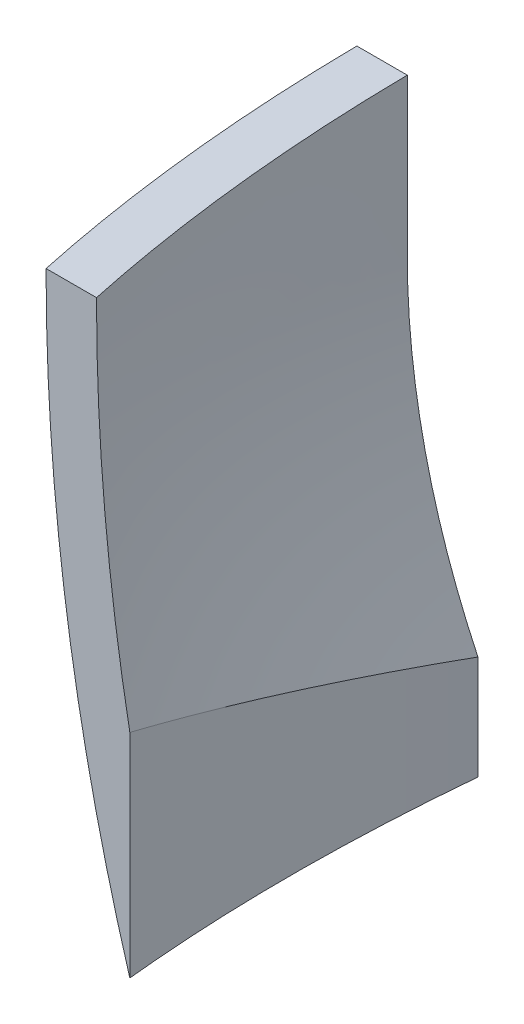
ISO-10303-21;
HEADER;
FILE_DESCRIPTION(('STEP AP214'),'2;1');
FILE_NAME('part.step','',(''),(''),'','','');
FILE_SCHEMA(('AUTOMOTIVE_DESIGN { 1 0 10303 214 1 1 1 1 }'));
ENDSEC;
DATA;
#1=APPLICATION_CONTEXT('core data for automotive mechanical design processes');
#2=APPLICATION_PROTOCOL_DEFINITION('international standard','automotive_design',2000,#1);
#3=PRODUCT_CONTEXT('',#1,'mechanical');
#4=PRODUCT('Part','Part','',(#3));
#5=PRODUCT_RELATED_PRODUCT_CATEGORY('part','',(#4));
#6=PRODUCT_DEFINITION_FORMATION('','',#4);
#7=PRODUCT_DEFINITION_CONTEXT('part definition',#1,'design');
#8=PRODUCT_DEFINITION('design','',#6,#7);
#9=PRODUCT_DEFINITION_SHAPE('','',#8);
#10=(LENGTH_UNIT() NAMED_UNIT(*) SI_UNIT(.MILLI.,.METRE.));
#11=(NAMED_UNIT(*) PLANE_ANGLE_UNIT() SI_UNIT($,.RADIAN.));
#12=(NAMED_UNIT(*) SI_UNIT($,.STERADIAN.) SOLID_ANGLE_UNIT());
#13=UNCERTAINTY_MEASURE_WITH_UNIT(LENGTH_MEASURE(1.E-05),#10,'distance_accuracy_value','');
#14=(GEOMETRIC_REPRESENTATION_CONTEXT(3) GLOBAL_UNCERTAINTY_ASSIGNED_CONTEXT((#13)) GLOBAL_UNIT_ASSIGNED_CONTEXT((#10,
#11,#12)) REPRESENTATION_CONTEXT('',''));
#15=CARTESIAN_POINT('',(0.,0.,0.));
#16=DIRECTION('',(0.,0.,1.));
#17=DIRECTION('',(1.,0.,0.));
#18=AXIS2_PLACEMENT_3D('',#15,#16,#17);
#19=CARTESIAN_POINT('',(293.472310864154,43.37710450171,0.));
#20=DIRECTION('',(0.,0.,-1.));
#21=DIRECTION('',(1.,0.,0.));
#22=AXIS2_PLACEMENT_3D('',#19,#20,#21);
#23=PLANE('',#22);
#24=CARTESIAN_POINT('',(293.472310864154,43.37710450171,0.));
#25=DIRECTION('',(0.,0.,-1.));
#26=DIRECTION('',(1.,0.,0.));
#27=AXIS2_PLACEMENT_3D('',#24,#25,#26);
#28=CIRCLE('',#27,382.072310864153);
#29=CARTESIAN_POINT('',(-81.9999999999987,-27.3321205216683,0.));
#30=VERTEX_POINT('',#29);
#31=CARTESIAN_POINT('',(-88.5999999999987,43.3771045017101,0.));
#32=VERTEX_POINT('',#31);
#33=EDGE_CURVE('E113',#30,#32,#28,.T.);
#34=ORIENTED_EDGE('',*,*,#33,.T.);
#35=DIRECTION('',(0.,1.,0.));
#36=VECTOR('',#35,1.);
#37=CARTESIAN_POINT('',(-88.5999999999987,44.0000000000006,0.));
#38=LINE('',#37,#36);
#39=CARTESIAN_POINT('',(-88.5999999999987,44.0000000000006,0.));
#40=VERTEX_POINT('',#39);
#41=EDGE_CURVE('E11',#32,#40,#38,.T.);
#42=ORIENTED_EDGE('',*,*,#41,.T.);
#43=DIRECTION('',(-1.,0.,0.));
#44=VECTOR('',#43,1.);
#45=CARTESIAN_POINT('',(293.472310864154,44.0000000000006,0.));
#46=LINE('',#45,#44);
#47=CARTESIAN_POINT('',(-98.5999999999987,44.0000000000006,0.));
#48=VERTEX_POINT('',#47);
#49=EDGE_CURVE('E52',#40,#48,#46,.T.);
#50=ORIENTED_EDGE('',*,*,#49,.T.);
#51=DIRECTION('',(0.,1.,0.));
#52=VECTOR('',#51,1.);
#53=CARTESIAN_POINT('',(-98.5999999999987,44.0000000000006,0.));
#54=LINE('',#53,#52);
#55=CARTESIAN_POINT('',(-98.5999999999987,43.37710450171,0.));
#56=VERTEX_POINT('',#55);
#57=EDGE_CURVE('E108',#56,#48,#54,.T.);
#58=ORIENTED_EDGE('',*,*,#57,.F.);
#59=CARTESIAN_POINT('',(293.472310864154,43.37710450171,0.));
#60=DIRECTION('',(0.,0.,1.));
#61=DIRECTION('',(1.,0.,0.));
#62=AXIS2_PLACEMENT_3D('',#59,#60,#61);
#63=CIRCLE('',#62,392.072310864153);
#64=CARTESIAN_POINT('',(-81.9999999999987,-69.4999999999994,0.));
#65=VERTEX_POINT('',#64);
#66=EDGE_CURVE('E66',#56,#65,#63,.T.);
#67=ORIENTED_EDGE('',*,*,#66,.T.);
#68=DIRECTION('',(0.,1.,0.));
#69=VECTOR('',#68,1.);
#70=CARTESIAN_POINT('',(-81.9999999999987,-27.3321205216683,0.));
#71=LINE('',#70,#69);
#72=EDGE_CURVE('E225',#65,#30,#71,.T.);
#73=ORIENTED_EDGE('',*,*,#72,.T.);
#74=EDGE_LOOP('',(#34,#42,#50,#58,#67,#73));
#75=FACE_BOUND('',#74,.T.);
#76=ADVANCED_FACE('F41',(#75),#23,.F.);
#77=CARTESIAN_POINT('',(47.7968750004928,13.0000000000125,-69.0000000000018));
#78=DIRECTION('',(0.,0.,1.));
#79=DIRECTION('',(-1.,0.,0.));
#80=AXIS2_PLACEMENT_3D('',#77,#78,#79);
#81=PLANE('',#80);
#82=DIRECTION('',(-4.95750394141011E-12,1.,0.));
#83=VECTOR('',#82,1.);
#84=CARTESIAN_POINT('',(-105.999999999724,43.9999999999975,-69.0000000000018));
#85=LINE('',#84,#83);
#86=CARTESIAN_POINT('',(-105.99999999957,12.9999999999975,-69.0000000000018));
#87=VERTEX_POINT('',#86);
#88=CARTESIAN_POINT('',(-105.999999999724,43.9999999999975,-69.0000000000018));
#89=VERTEX_POINT('',#88);
#90=EDGE_CURVE('E106',#87,#89,#85,.T.);
#91=ORIENTED_EDGE('',*,*,#90,.T.);
#92=DIRECTION('',(1.,0.,0.));
#93=VECTOR('',#92,1.);
#94=CARTESIAN_POINT('',(47.7968750004928,43.9999999999975,-69.0000000000018));
#95=LINE('',#94,#93);
#96=CARTESIAN_POINT('',(-95.9999999999987,43.9999999999975,-69.0000000000018));
#97=VERTEX_POINT('',#96);
#98=EDGE_CURVE('E118',#89,#97,#95,.T.);
#99=ORIENTED_EDGE('',*,*,#98,.T.);
#100=DIRECTION('',(0.,-1.,0.));
#101=VECTOR('',#100,1.);
#102=CARTESIAN_POINT('',(-95.9999999999987,43.9999999999975,-69.0000000000018));
#103=LINE('',#102,#101);
#104=CARTESIAN_POINT('',(-95.9999999999987,33.9999999988572,-69.0000000000018));
#105=VERTEX_POINT('',#104);
#106=EDGE_CURVE('E123',#97,#105,#103,.T.);
#107=ORIENTED_EDGE('',*,*,#106,.T.);
#108=DIRECTION('',(0.,-1.,0.));
#109=VECTOR('',#108,1.);
#110=CARTESIAN_POINT('',(-95.9999999999987,33.9999999999975,-69.0000000000018));
#111=LINE('',#110,#109);
#112=CARTESIAN_POINT('',(-95.9999999999453,13.0000000002962,-69.0000000000018));
#113=VERTEX_POINT('',#112);
#114=EDGE_CURVE('E191',#105,#113,#111,.T.);
#115=ORIENTED_EDGE('',*,*,#114,.T.);
#116=CARTESIAN_POINT('',(47.7968750004928,13.0000000000125,-69.0000000000018));
#117=DIRECTION('',(0.,0.,1.));
#118=DIRECTION('',(-1.,0.,0.));
#119=AXIS2_PLACEMENT_3D('',#116,#117,#118);
#120=CIRCLE('',#119,143.796875000277);
#121=CARTESIAN_POINT('',(-81.9999999999988,-48.8895184978859,-69.0000000000018));
#122=VERTEX_POINT('',#121);
#123=EDGE_CURVE('E186',#113,#122,#120,.T.);
#124=ORIENTED_EDGE('',*,*,#123,.T.);
#125=DIRECTION('',(2.08087886916519E-11,-1.,0.));
#126=VECTOR('',#125,1.);
#127=CARTESIAN_POINT('',(-81.9999999995699,-69.500000000004,-69.0000000000018));
#128=LINE('',#127,#126);
#129=CARTESIAN_POINT('',(-81.9999999995703,-69.5000000000042,-69.0000000000018));
#130=VERTEX_POINT('',#129);
#131=EDGE_CURVE('E180',#122,#130,#128,.T.);
#132=ORIENTED_EDGE('',*,*,#131,.T.);
#133=CARTESIAN_POINT('',(47.7968750004928,13.0000000000125,-69.0000000000018));
#134=DIRECTION('',(0.,0.,-1.));
#135=DIRECTION('',(-1.,0.,0.));
#136=AXIS2_PLACEMENT_3D('',#133,#134,#135);
#137=CIRCLE('',#136,153.796875000062);
#138=EDGE_CURVE('E128',#130,#87,#137,.T.);
#139=ORIENTED_EDGE('',*,*,#138,.T.);
#140=EDGE_LOOP('',(#91,#99,#107,#115,#124,#132,#139));
#141=FACE_BOUND('',#140,.T.);
#142=ADVANCED_FACE('F126',(#141),#81,.F.);
#143=CARTESIAN_POINT('',(-81.9999999995703,-69.5000000000042,-69.0000000000018));
#144=CARTESIAN_POINT('',(-84.1908103200391,-69.5000000000026,-45.241721401937));
#145=CARTESIAN_POINT('',(-84.2631564827319,-69.500000000001,-22.1008436879174));
#146=CARTESIAN_POINT('',(-81.9999999999987,-69.4999999999994,0.));
#147=CARTESIAN_POINT('',(-85.6689657134802,-63.7276329194251,-69.0000000000018));
#148=CARTESIAN_POINT('',(-87.5916872120858,-62.475394429924,-45.241721401937));
#149=CARTESIAN_POINT('',(-87.3959445529155,-61.2231559404229,-22.1008436879174));
#150=CARTESIAN_POINT('',(-84.8646992483191,-59.9709174509218,0.));
#151=CARTESIAN_POINT('',(-92.199240831058,-51.7628209844033,-69.0000000000017));
#152=CARTESIAN_POINT('',(-93.6452289868945,-47.9536031292892,-45.241721401937));
#153=CARTESIAN_POINT('',(-92.972752984955,-44.1443852741752,-22.1008436879173));
#154=CARTESIAN_POINT('',(-89.9647743375895,-40.3351674190612,0.));
#155=CARTESIAN_POINT('',(-98.4136459689345,-35.6135344487323,-69.0000000000018));
#156=CARTESIAN_POINT('',(-99.2499345390836,-28.9519178407417,-45.241721401937));
#157=CARTESIAN_POINT('',(-97.9677589514568,-22.290301232751,-22.1008436879174));
#158=CARTESIAN_POINT('',(-94.350080718404,-15.6286846247604,0.));
#159=CARTESIAN_POINT('',(-102.141988434971,-21.8056858802479,-69.0000000000018));
#160=CARTESIAN_POINT('',(-102.502180392754,-13.3774625341844,-45.241721401937));
#161=CARTESIAN_POINT('',(-100.743908192761,-4.94923918812084,-22.1008436879174));
#162=CARTESIAN_POINT('',(-96.6501333473424,3.47898415794269,0.));
#163=CARTESIAN_POINT('',(-104.266600538542,-10.9299496511044,-69.0000000000018));
#164=CARTESIAN_POINT('',(-104.307266006238,-1.49616436878978,-45.241721401937));
#165=CARTESIAN_POINT('',(-102.229467316158,7.93762091352483,-22.1008436879173));
#166=CARTESIAN_POINT('',(-97.8161659806517,17.3714061958395,0.));
#167=CARTESIAN_POINT('',(-105.64955206799,0.564216099308913,-69.0000000000018));
#168=CARTESIAN_POINT('',(-105.446605423996,10.6147866868206,-45.241721401937));
#169=CARTESIAN_POINT('',(-103.125194622225,20.6653572743322,-22.1008436879174));
#170=CARTESIAN_POINT('',(-98.4682811750285,30.7159278618439,0.));
#171=CARTESIAN_POINT('',(-105.999999999569,8.74115216883132,-69.0000000000018));
#172=CARTESIAN_POINT('',(-105.724143653372,18.9024163664831,-45.241721401937));
#173=CARTESIAN_POINT('',(-103.329823149398,29.0636805641349,-22.1008436879174));
#174=CARTESIAN_POINT('',(-98.5999999999987,39.2249447617867,0.));
#175=CARTESIAN_POINT('',(-105.99999999957,13.0413180863678,-69.0000000000018));
#176=CARTESIAN_POINT('',(-105.724143653372,23.1666745680337,-45.241721401937));
#177=CARTESIAN_POINT('',(-103.329823149399,33.2920310496997,-22.1008436879174));
#178=CARTESIAN_POINT('',(-98.5999999999987,43.4173875313656,0.));
#179=CARTESIAN_POINT('',(-105.99999999957,13.1037546215268,-69.0000000000018));
#180=CARTESIAN_POINT('',(-105.724143653372,23.1964742197901,-45.241721401937));
#181=CARTESIAN_POINT('',(-103.329823149399,33.2891938180534,-22.1008436879174));
#182=CARTESIAN_POINT('',(-98.5999999999987,43.3819134163167,0.));
#183=CARTESIAN_POINT('',(-105.999999999571,13.1774382592689,-69.0000000000018));
#184=CARTESIAN_POINT('',(-105.724143653373,23.2596541388195,-45.241721401937));
#185=CARTESIAN_POINT('',(-103.329823149399,33.3418700183701,-22.1008436879174));
#186=CARTESIAN_POINT('',(-98.5999999999987,43.4240858979207,0.));
#187=CARTESIAN_POINT('',(-105.999999999571,13.2144949631804,-69.0000000000018));
#188=CARTESIAN_POINT('',(-105.724143653373,23.2798616774904,-45.241721401937));
#189=CARTESIAN_POINT('',(-103.329823149399,33.3452283918004,-22.1008436879174));
#190=CARTESIAN_POINT('',(-98.5999999999987,43.4105951061104,0.));
#191=CARTESIAN_POINT('',(-105.999999999571,13.2357322799548,-69.0000000000018));
#192=CARTESIAN_POINT('',(-105.724143653373,23.2974803503089,-45.241721401937));
#193=CARTESIAN_POINT('',(-103.329823149399,33.3592284206629,-22.1008436879174));
#194=CARTESIAN_POINT('',(-98.5999999999987,43.420976491017,0.));
#195=CARTESIAN_POINT('',(-105.999999999571,13.2676506433478,-69.0000000000018));
#196=CARTESIAN_POINT('',(-105.724143653373,23.3180724300584,-45.241721401937));
#197=CARTESIAN_POINT('',(-103.329823149399,33.368494216769,-22.1008436879174));
#198=CARTESIAN_POINT('',(-98.5999999999987,43.4189160034795,0.));
#199=CARTESIAN_POINT('',(-105.999999999571,13.3157633849377,-69.0000000000018));
#200=CARTESIAN_POINT('',(-105.724143653373,23.3531664944067,-45.241721401937));
#201=CARTESIAN_POINT('',(-103.329823149399,33.3905696038758,-22.1008436879174));
#202=CARTESIAN_POINT('',(-98.5999999999987,43.4279727133449,0.));
#203=CARTESIAN_POINT('',(-105.999999999572,13.3696489360882,-69.0000000000018));
#204=CARTESIAN_POINT('',(-105.724143653373,23.3895453193955,-45.241721401937));
#205=CARTESIAN_POINT('',(-103.329823149399,33.4094417027027,-22.1008436879174));
#206=CARTESIAN_POINT('',(-98.5999999999988,43.42933808601,0.));
#207=CARTESIAN_POINT('',(-105.999999999572,13.4130188400023,-69.0000000000018));
#208=CARTESIAN_POINT('',(-105.724143653373,23.4199750379318,-45.241721401937));
#209=CARTESIAN_POINT('',(-103.329823149399,33.4269312358612,-22.1008436879173));
#210=CARTESIAN_POINT('',(-98.5999999999986,43.4338874337907,0.));
#211=CARTESIAN_POINT('',(-105.999999999572,13.4456783227756,-69.0000000000018));
#212=CARTESIAN_POINT('',(-105.724143653374,23.4423541082036,-45.241721401937));
#213=CARTESIAN_POINT('',(-103.329823149399,33.4390298936316,-22.1008436879173));
#214=CARTESIAN_POINT('',(-98.5999999999988,43.4357056790597,0.));
#215=CARTESIAN_POINT('',(-105.999999999572,13.4784711837275,-69.0000000000018));
#216=CARTESIAN_POINT('',(-105.724143653374,23.4650625139528,-45.241721401937));
#217=CARTESIAN_POINT('',(-103.329823149399,33.4516538441781,-22.1008436879173));
#218=CARTESIAN_POINT('',(-98.5999999999985,43.4382451744033,0.));
#219=CARTESIAN_POINT('',(-105.999999999572,13.5031668555812,-69.0000000000018));
#220=CARTESIAN_POINT('',(-105.724143653374,23.4820301354838,-45.241721401937));
#221=CARTESIAN_POINT('',(-103.329823149399,33.4608934153863,-22.1008436879173));
#222=CARTESIAN_POINT('',(-98.5999999999989,43.4397566952889,0.));
#223=CARTESIAN_POINT('',(-105.999999999572,13.519673144586,-69.0000000000018));
#224=CARTESIAN_POINT('',(-105.724143653374,23.493424509904,-45.241721401937));
#225=CARTESIAN_POINT('',(-103.329823149399,33.467175875222,-22.1008436879173));
#226=CARTESIAN_POINT('',(-98.5999999999986,43.44092724054,0.));
#227=CARTESIAN_POINT('',(-105.999999999572,13.5279348113194,-69.0000000000018));
#228=CARTESIAN_POINT('',(-105.724143653374,23.4990986055526,-45.241721401937));
#229=CARTESIAN_POINT('',(-103.329823149399,33.4702623997859,-22.1008436879173));
#230=CARTESIAN_POINT('',(-98.5999999999987,43.4414261940192,0.));
#231=CARTESIAN_POINT('',(-105.999999999572,13.5362050209609,-69.0000000000018));
#232=CARTESIAN_POINT('',(-105.724143653374,23.5047997287603,-45.241721401937));
#233=CARTESIAN_POINT('',(-103.329823149399,33.4733944365596,-22.1008436879173));
#234=CARTESIAN_POINT('',(-98.5999999999987,43.4419891443589,0.));
#235=CARTESIAN_POINT('',(-105.999999999573,13.5444837941878,-69.0000000000018));
#236=CARTESIAN_POINT('',(-105.724143653374,23.5104922178391,-45.241721401937));
#237=CARTESIAN_POINT('',(-103.329823149399,33.4765006414904,-22.1008436879173));
#238=CARTESIAN_POINT('',(-98.5999999999988,43.4425090651417,0.));
#239=CARTESIAN_POINT('',(-105.999999999573,13.5527711516773,-69.0000000000018));
#240=CARTESIAN_POINT('',(-105.724143653374,23.5161964206278,-45.241721401937));
#241=CARTESIAN_POINT('',(-103.329823149399,33.4796216895783,-22.1008436879173));
#242=CARTESIAN_POINT('',(-98.5999999999986,43.4430469585288,0.));
#243=CARTESIAN_POINT('',(-105.999999999573,13.5610671141064,-69.0000000000018));
#244=CARTESIAN_POINT('',(-105.724143653374,23.5219013306976,-45.241721401937));
#245=CARTESIAN_POINT('',(-103.329823149399,33.4827355472887,-22.1008436879173));
#246=CARTESIAN_POINT('',(-98.5999999999989,43.4435697638799,0.));
#247=CARTESIAN_POINT('',(-105.999999999573,13.5693717021524,-69.0000000000018));
#248=CARTESIAN_POINT('',(-105.724143653374,23.527612936301,-45.241721401937));
#249=CARTESIAN_POINT('',(-103.329823149399,33.4858541704495,-22.1008436879174));
#250=CARTESIAN_POINT('',(-98.5999999999986,43.444095404598,0.));
#251=CARTESIAN_POINT('',(-105.999999999573,13.5776849364926,-69.0000000000018));
#252=CARTESIAN_POINT('',(-105.724143653374,23.5333280781905,-45.241721401937));
#253=CARTESIAN_POINT('',(-103.329823149399,33.4889712198883,-22.1008436879174));
#254=CARTESIAN_POINT('',(-98.5999999999987,43.4446143615862,0.));
#255=CARTESIAN_POINT('',(-105.999999999573,13.5860068378042,-69.0000000000018));
#256=CARTESIAN_POINT('',(-105.724143653374,23.5390485101105,-45.241721401937));
#257=CARTESIAN_POINT('',(-103.329823149399,33.4920901824168,-22.1008436879174));
#258=CARTESIAN_POINT('',(-98.5999999999987,43.4451318547231,0.));
#259=CARTESIAN_POINT('',(-105.999999999573,13.5943374267644,-69.0000000000018));
#260=CARTESIAN_POINT('',(-105.724143653374,23.5447733470122,-45.241721401937));
#261=CARTESIAN_POINT('',(-103.329823149399,33.4952092672601,-22.1008436879174));
#262=CARTESIAN_POINT('',(-98.5999999999986,43.445645187508,0.));
#263=CARTESIAN_POINT('',(-105.999999999573,13.6026767240503,-69.0000000000018));
#264=CARTESIAN_POINT('',(-105.724143653374,23.5505031179613,-45.241721401937));
#265=CARTESIAN_POINT('',(-103.3298231494,33.4983295118723,-22.1008436879174));
#266=CARTESIAN_POINT('',(-98.5999999999988,43.4461559057834,0.));
#267=CARTESIAN_POINT('',(-105.999999999573,13.6110247503395,-69.0000000000018));
#268=CARTESIAN_POINT('',(-105.724143653374,23.5562375945782,-45.241721401937));
#269=CARTESIAN_POINT('',(-103.329823149399,33.501450438817,-22.1008436879174));
#270=CARTESIAN_POINT('',(-98.5999999999986,43.4466632830557,0.));
#271=CARTESIAN_POINT('',(-105.999999999573,13.6193815263089,-69.0000000000018));
#272=CARTESIAN_POINT('',(-105.724143653374,23.5619769487229,-45.241721401937));
#273=CARTESIAN_POINT('',(-103.3298231494,33.5045723711369,-22.1008436879174));
#274=CARTESIAN_POINT('',(-98.5999999999988,43.4471677935509,0.));
#275=CARTESIAN_POINT('',(-105.999999999573,13.6305355880779,-69.0000000000018));
#276=CARTESIAN_POINT('',(-105.724143653374,23.5696358780609,-45.241721401937));
#277=CARTESIAN_POINT('',(-103.329823149399,33.5087361680439,-22.1008436879174));
#278=CARTESIAN_POINT('',(-98.5999999999986,43.4478364580269,0.));
#279=CARTESIAN_POINT('',(-105.999999999573,13.641707231916,-69.0000000000018));
#280=CARTESIAN_POINT('',(-105.724143653374,23.5773046146135,-45.241721401937));
#281=CARTESIAN_POINT('',(-103.3298231494,33.512901997311,-22.1008436879174));
#282=CARTESIAN_POINT('',(-98.5999999999988,43.4484993800084,0.));
#283=CARTESIAN_POINT('',(-105.999999999573,13.6528965405322,-69.0000000000018));
#284=CARTESIAN_POINT('',(-105.724143653374,23.5849832654169,-45.241721401937));
#285=CARTESIAN_POINT('',(-103.3298231494,33.5170699903017,-22.1008436879174));
#286=CARTESIAN_POINT('',(-98.5999999999987,43.4491567151864,0.));
#287=CARTESIAN_POINT('',(-105.999999999573,13.6612973750605,-69.0000000000018));
#288=CARTESIAN_POINT('',(-105.724143653374,23.5907472485892,-45.241721401937));
#289=CARTESIAN_POINT('',(-103.3298231494,33.5201971221179,-22.1008436879174));
#290=CARTESIAN_POINT('',(-98.5999999999989,43.4496469956466,0.));
#291=CARTESIAN_POINT('',(-105.999999999573,13.6697070833322,-69.0000000000018));
#292=CARTESIAN_POINT('',(-105.724143653374,23.5965162521717,-45.241721401937));
#293=CARTESIAN_POINT('',(-103.329823149399,33.5233254210113,-22.1008436879174));
#294=CARTESIAN_POINT('',(-98.5999999999985,43.4501345898509,0.));
#295=CARTESIAN_POINT('',(-105.999999999573,13.6781256860245,-69.0000000000018));
#296=CARTESIAN_POINT('',(-105.724143653374,23.6022903092631,-45.241721401937));
#297=CARTESIAN_POINT('',(-103.3298231494,33.5264549325018,-22.1008436879173));
#298=CARTESIAN_POINT('',(-98.5999999999989,43.4506195557404,0.));
#299=CARTESIAN_POINT('',(-105.999999999573,13.6865532038145,-69.0000000000018));
#300=CARTESIAN_POINT('',(-105.724143653374,23.608069447825,-45.241721401937));
#301=CARTESIAN_POINT('',(-103.3298231494,33.5295856918354,-22.1008436879173));
#302=CARTESIAN_POINT('',(-98.5999999999987,43.4511019358458,0.));
#303=CARTESIAN_POINT('',(-105.999999999573,13.6949896573794,-69.0000000000018));
#304=CARTESIAN_POINT('',(-105.724143653374,23.6138536976359,-45.241721401937));
#305=CARTESIAN_POINT('',(-103.3298231494,33.5327177378924,-22.1008436879173));
#306=CARTESIAN_POINT('',(-98.5999999999987,43.4515817781489,0.));
#307=CARTESIAN_POINT('',(-105.999999999573,13.7034350673964,-69.0000000000018));
#308=CARTESIAN_POINT('',(-105.724143653374,23.6196430873025,-45.241721401937));
#309=CARTESIAN_POINT('',(-103.3298231494,33.5358511072087,-22.1008436879173));
#310=CARTESIAN_POINT('',(-98.5999999999987,43.4520591271148,0.));
#311=CARTESIAN_POINT('',(-105.999999999573,13.7118894545428,-69.0000000000018));
#312=CARTESIAN_POINT('',(-105.724143653374,23.6254376444716,-45.241721401937));
#313=CARTESIAN_POINT('',(-103.3298231494,33.5389858344003,-22.1008436879173));
#314=CARTESIAN_POINT('',(-98.5999999999988,43.452534024329,0.));
#315=CARTESIAN_POINT('',(-105.999999999573,13.7203528394958,-69.0000000000018));
#316=CARTESIAN_POINT('',(-105.724143653374,23.6312373983481,-45.241721401937));
#317=CARTESIAN_POINT('',(-103.3298231494,33.5421219572004,-22.1008436879173));
#318=CARTESIAN_POINT('',(-98.5999999999987,43.4530065160528,0.));
#319=CARTESIAN_POINT('',(-105.999999999573,13.7316493774117,-69.0000000000017));
#320=CARTESIAN_POINT('',(-105.724143653375,23.6389773658781,-45.241721401937));
#321=CARTESIAN_POINT('',(-103.3298231494,33.5463053543446,-22.1008436879173));
#322=CARTESIAN_POINT('',(-98.5999999999988,43.4536333428111,0.));
#323=CARTESIAN_POINT('',(-105.999999999574,13.7514499558281,-69.0000000000018));
#324=CARTESIAN_POINT('',(-105.724143653375,23.652540689064,-45.241721401937));
#325=CARTESIAN_POINT('',(-103.3298231494,33.5536314223,-22.1008436879173));
#326=CARTESIAN_POINT('',(-98.5999999999987,43.4547221555359,0.));
#327=CARTESIAN_POINT('',(-105.999999999574,13.7911782398767,-69.0000000000018));
#328=CARTESIAN_POINT('',(-105.724143653375,23.6797415734216,-45.241721401937));
#329=CARTESIAN_POINT('',(-103.3298231494,33.5683049069666,-22.1008436879173));
#330=CARTESIAN_POINT('',(-98.5999999999987,43.4568682405115,0.));
#331=CARTESIAN_POINT('',(-105.999999999574,13.8482994603429,-69.0000000000018));
#332=CARTESIAN_POINT('',(-105.724143653375,23.7188162472444,-45.241721401937));
#333=CARTESIAN_POINT('',(-103.3298231494,33.589333034146,-22.1008436879173));
#334=CARTESIAN_POINT('',(-98.5999999999989,43.4598498210475,0.));
#335=CARTESIAN_POINT('',(-105.999999999574,13.9059182083724,-69.0000000000018));
#336=CARTESIAN_POINT('',(-105.724143653375,23.7581894573905,-45.241721401937));
#337=CARTESIAN_POINT('',(-103.3298231494,33.6104607064085,-22.1008436879173));
#338=CARTESIAN_POINT('',(-98.5999999999985,43.4627319554265,0.));
#339=CARTESIAN_POINT('',(-105.999999999575,13.9523170166975,-69.0000000000018));
#340=CARTESIAN_POINT('',(-105.724143653375,23.7898727886284,-45.241721401937));
#341=CARTESIAN_POINT('',(-103.3298231494,33.6274285605593,-22.1008436879173));
#342=CARTESIAN_POINT('',(-98.5999999999989,43.4649843324903,0.));
#343=CARTESIAN_POINT('',(-105.999999999575,13.9814439621434,-69.0000000000018));
#344=CARTESIAN_POINT('',(-105.724143653375,23.8097529655777,-45.241721401937));
#345=CARTESIAN_POINT('',(-103.3298231494,33.6380619690119,-22.1008436879173));
#346=CARTESIAN_POINT('',(-98.5999999999986,43.4663709724461,0.));
#347=CARTESIAN_POINT('',(-105.999999999575,14.0048227943164,-69.0000000000018));
#348=CARTESIAN_POINT('',(-105.724143653375,23.8257046230106,-45.241721401937));
#349=CARTESIAN_POINT('',(-103.3298231494,33.6465864517048,-22.1008436879173));
#350=CARTESIAN_POINT('',(-98.5999999999987,43.4674682803991,0.));
#351=CARTESIAN_POINT('',(-105.999999999575,14.0282533642572,-69.0000000000018));
#352=CARTESIAN_POINT('',(-105.724143653376,23.8416881670366,-45.241721401937));
#353=CARTESIAN_POINT('',(-103.3298231494,33.6551229698161,-22.1008436879173));
#354=CARTESIAN_POINT('',(-98.5999999999988,43.4685577725956,0.));
#355=CARTESIAN_POINT('',(-105.999999999575,14.0517618716849,-69.0000000000018));
#356=CARTESIAN_POINT('',(-105.724143653376,23.8577198627518,-45.241721401937));
#357=CARTESIAN_POINT('',(-103.3298231494,33.6636778538187,-22.1008436879173));
#358=CARTESIAN_POINT('',(-98.5999999999986,43.4696358448856,0.));
#359=CARTESIAN_POINT('',(-105.999999999575,14.0753489782697,-69.0000000000018));
#360=CARTESIAN_POINT('',(-105.724143653376,23.8738003296083,-45.241721401937));
#361=CARTESIAN_POINT('',(-103.3298231494,33.6722516809468,-22.1008436879173));
#362=CARTESIAN_POINT('',(-98.5999999999988,43.4707030322854,0.));
#363=CARTESIAN_POINT('',(-105.999999999575,14.0989887048492,-69.0000000000017));
#364=CARTESIAN_POINT('',(-105.724143653376,23.8899135158771,-45.241721401937));
#365=CARTESIAN_POINT('',(-103.3298231494,33.6808383269049,-22.1008436879173));
#366=CARTESIAN_POINT('',(-98.5999999999986,43.4717631379328,0.));
#367=CARTESIAN_POINT('',(-105.999999999575,14.1227076922559,-69.0000000000017));
#368=CARTESIAN_POINT('',(-105.724143653376,23.9060760795153,-45.241721401937));
#369=CARTESIAN_POINT('',(-103.3298231494,33.6894444667746,-22.1008436879173));
#370=CARTESIAN_POINT('',(-98.5999999999989,43.472812854034,0.));
#371=CARTESIAN_POINT('',(-105.999999999576,14.1465066021606,-69.0000000000017));
#372=CARTESIAN_POINT('',(-105.724143653376,23.922288625378,-45.241721401937));
#373=CARTESIAN_POINT('',(-103.3298231494,33.6980706485954,-22.1008436879173));
#374=CARTESIAN_POINT('',(-98.5999999999986,43.4738526718128,0.));
#375=CARTESIAN_POINT('',(-105.999999999576,14.1643959112559,-69.0000000000017));
#376=CARTESIAN_POINT('',(-105.724143653376,23.9344731610669,-45.241721401937));
#377=CARTESIAN_POINT('',(-103.3298231494,33.7045504108778,-22.1008436879173));
#378=CARTESIAN_POINT('',(-98.5999999999988,43.4746276606888,0.));
#379=CARTESIAN_POINT('',(-105.999999999576,14.1823255124356,-69.0000000000017));
#380=CARTESIAN_POINT('',(-105.724143653376,23.9466829929436,-45.241721401937));
#381=CARTESIAN_POINT('',(-103.3298231494,33.7110404734517,-22.1008436879173));
#382=CARTESIAN_POINT('',(-98.5999999999986,43.4753979539597,0.));
#383=CARTESIAN_POINT('',(-105.999999999576,14.2422257080401,-69.0000000000017));
#384=CARTESIAN_POINT('',(-105.724143653376,23.9874671233468,-45.241721401937));
#385=CARTESIAN_POINT('',(-103.329823149401,33.7327085386535,-22.1008436879173));
#386=CARTESIAN_POINT('',(-98.5999999999989,43.4779499539602,0.));
#387=CARTESIAN_POINT('',(-105.999999999576,14.3450919250128,-69.0000000000017));
#388=CARTESIAN_POINT('',(-105.724143653376,24.0574523160377,-45.241721401937));
#389=CARTESIAN_POINT('',(-103.3298231494,33.7698127070625,-22.1008436879173));
#390=CARTESIAN_POINT('',(-98.5999999999984,43.4821730980873,0.));
#391=CARTESIAN_POINT('',(-105.999999999577,14.4929993802202,-69.0000000000017));
#392=CARTESIAN_POINT('',(-105.724143653377,24.1579625560638,-45.241721401937));
#393=CARTESIAN_POINT('',(-103.329823149401,33.8229257319073,-22.1008436879173));
#394=CARTESIAN_POINT('',(-98.5999999999991,43.4878889077509,0.));
#395=CARTESIAN_POINT('',(-105.999999999578,14.6436760899007,-69.0000000000017));
#396=CARTESIAN_POINT('',(-105.724143653377,24.2602481412049,-45.241721401937));
#397=CARTESIAN_POINT('',(-103.329823149401,33.8768201925091,-22.1008436879173));
#398=CARTESIAN_POINT('',(-98.5999999999984,43.4933922438133,0.));
#399=CARTESIAN_POINT('',(-105.999999999579,14.7972067478699,-69.0000000000017));
#400=CARTESIAN_POINT('',(-105.724143653378,24.3643744970344,-45.241721401937));
#401=CARTESIAN_POINT('',(-103.329823149402,33.9315422461988,-22.1008436879173));
#402=CARTESIAN_POINT('',(-98.5999999999991,43.4987099953633,0.));
#403=CARTESIAN_POINT('',(-105.99999999958,14.9536760479435,-69.0000000000017));
#404=CARTESIAN_POINT('',(-105.724143653378,24.470405358764,-45.241721401937));
#405=CARTESIAN_POINT('',(-103.329823149402,33.9871346695846,-22.1008436879173));
#406=CARTESIAN_POINT('',(-98.5999999999986,43.5038639804051,0.));
#407=CARTESIAN_POINT('',(-105.99999999958,15.1131686839368,-69.0000000000017));
#408=CARTESIAN_POINT('',(-105.724143653379,24.578403248305,-45.241721401937));
#409=CARTESIAN_POINT('',(-103.329823149402,34.0436378126732,-22.1008436879173));
#410=CARTESIAN_POINT('',(-98.5999999999988,43.5088723770415,0.));
#411=CARTESIAN_POINT('',(-105.999999999581,15.3299695715743,-69.0000000000017));
#412=CARTESIAN_POINT('',(-105.72414365338,24.725105023834,-45.241721401937));
#413=CARTESIAN_POINT('',(-103.329823149402,34.1202404760936,-22.1008436879173));
#414=CARTESIAN_POINT('',(-98.5999999999987,43.5153759283533,0.));
#415=CARTESIAN_POINT('',(-105.999999999583,15.6089524899966,-69.0000000000017));
#416=CARTESIAN_POINT('',(-105.724143653381,24.9137055455494,-45.241721401937));
#417=CARTESIAN_POINT('',(-103.329823149403,34.2184586011021,-22.1008436879173));
#418=CARTESIAN_POINT('',(-98.5999999999986,43.5232116566548,0.));
#419=CARTESIAN_POINT('',(-105.999999999585,16.0732564191035,-69.0000000000017));
#420=CARTESIAN_POINT('',(-105.724143653382,25.2272482424501,-45.241721401937));
#421=CARTESIAN_POINT('',(-103.329823149404,34.3812400657967,-22.1008436879173));
#422=CARTESIAN_POINT('',(-98.5999999999989,43.5352318891433,0.));
#423=CARTESIAN_POINT('',(-105.999999999588,16.6889513186028,-69.0000000000017));
#424=CARTESIAN_POINT('',(-105.724143653384,25.6424480853369,-45.241721401937));
#425=CARTESIAN_POINT('',(-103.329823149405,34.595944852071,-22.1008436879173));
#426=CARTESIAN_POINT('',(-98.5999999999986,43.5494416188051,0.));
#427=CARTESIAN_POINT('',(-105.999999999592,17.4897095831704,-69.0000000000017));
#428=CARTESIAN_POINT('',(-105.724143653387,26.1816573581205,-45.241721401937));
#429=CARTESIAN_POINT('',(-103.329823149406,34.8736051330707,-22.1008436879173));
#430=CARTESIAN_POINT('',(-98.5999999999987,43.5655529080208,0.));
#431=CARTESIAN_POINT('',(-105.999999999598,18.6471803217289,-69.0000000000017));
#432=CARTESIAN_POINT('',(-105.724143653391,26.9601372007728,-45.241721401937));
#433=CARTESIAN_POINT('',(-103.329823149408,35.2730940798166,-22.1008436879173));
#434=CARTESIAN_POINT('',(-98.5999999999988,43.5860509588604,0.));
#435=CARTESIAN_POINT('',(-105.999999999606,20.2759317287628,-69.0000000000018));
#436=CARTESIAN_POINT('',(-105.724143653396,28.0540557366024,-45.241721401937));
#437=CARTESIAN_POINT('',(-103.32982314941,35.832179744442,-22.1008436879173));
#438=CARTESIAN_POINT('',(-98.5999999999986,43.6103037522816,0.));
#439=CARTESIAN_POINT('',(-105.99999999962,23.1679685287858,-69.0000000000018));
#440=CARTESIAN_POINT('',(-105.724143653406,29.9943981261083,-45.241721401937));
#441=CARTESIAN_POINT('',(-103.329823149415,36.8208277234308,-22.1008436879174));
#442=CARTESIAN_POINT('',(-98.5999999999989,43.6472573207533,0.));
#443=CARTESIAN_POINT('',(-105.999999999636,26.3359874268429,-69.0000000000018));
#444=CARTESIAN_POINT('',(-105.724143653416,32.1182194450981,-45.241721401937));
#445=CARTESIAN_POINT('',(-103.32982314942,37.9004514633534,-22.1008436879174));
#446=CARTESIAN_POINT('',(-98.5999999999986,43.6826834816088,0.));
#447=CARTESIAN_POINT('',(-105.999999999651,29.4738489726947,-69.0000000000018));
#448=CARTESIAN_POINT('',(-105.724143653426,34.2219110256519,-45.241721401937));
#449=CARTESIAN_POINT('',(-103.329823149426,38.9699730786091,-22.1008436879174));
#450=CARTESIAN_POINT('',(-98.5999999999987,43.7180351315664,0.));
#451=CARTESIAN_POINT('',(-105.999999999663,31.7976054677814,-69.0000000000018));
#452=CARTESIAN_POINT('',(-105.724143653434,35.7800954725539,-45.241721401937));
#453=CARTESIAN_POINT('',(-103.32982314943,39.7625854773264,-22.1008436879174));
#454=CARTESIAN_POINT('',(-98.5999999999987,43.7450754820989,0.));
#455=CARTESIAN_POINT('',(-105.999999999674,34.077161310367,-69.0000000000018));
#456=CARTESIAN_POINT('',(-105.724143653442,37.3089590930562,-45.241721401937));
#457=CARTESIAN_POINT('',(-103.329823149433,40.5407568757454,-22.1008436879174));
#458=CARTESIAN_POINT('',(-98.5999999999987,43.7725546584345,0.));
#459=CARTESIAN_POINT('',(-105.999999999685,36.2979555122519,-69.0000000000018));
#460=CARTESIAN_POINT('',(-105.724143653449,38.7993325384986,-45.241721401937));
#461=CARTESIAN_POINT('',(-103.329823149437,41.3007095647452,-22.1008436879174));
#462=CARTESIAN_POINT('',(-98.5999999999988,43.8020865909919,0.));
#463=CARTESIAN_POINT('',(-105.999999999696,38.4454270852369,-69.0000000000018));
#464=CARTESIAN_POINT('',(-105.724143653456,40.2411238866728,-45.241721401937));
#465=CARTESIAN_POINT('',(-103.329823149441,42.0368206881086,-22.1008436879174));
#466=CARTESIAN_POINT('',(-98.5999999999988,43.8325174895445,0.));
#467=CARTESIAN_POINT('',(-105.999999999704,40.1398466017157,-69.0000000000018));
#468=CARTESIAN_POINT('',(-105.724143653462,41.3808766812368,-45.241721401937));
#469=CARTESIAN_POINT('',(-103.329823149443,42.6219067607578,-22.1008436879174));
#470=CARTESIAN_POINT('',(-98.5999999999986,43.8629368402789,0.));
#471=CARTESIAN_POINT('',(-105.999999999711,41.4178753761382,-69.0000000000018));
#472=CARTESIAN_POINT('',(-105.724143653466,42.2411688662112,-45.241721401937));
#473=CARTESIAN_POINT('',(-103.329823149445,43.0644623562842,-22.1008436879174));
#474=CARTESIAN_POINT('',(-98.5999999999988,43.8877558463572,0.));
#475=CARTESIAN_POINT('',(-105.999999999715,42.3325378470361,-69.0000000000018));
#476=CARTESIAN_POINT('',(-105.724143653469,42.8599878941579,-45.241721401937));
#477=CARTESIAN_POINT('',(-103.329823149447,43.3874379412796,-22.1008436879174));
#478=CARTESIAN_POINT('',(-98.5999999999986,43.9148879884014,0.));
#479=CARTESIAN_POINT('',(-105.999999999719,43.0539525724028,-69.0000000000018));
#480=CARTESIAN_POINT('',(-105.724143653471,43.3460832624638,-45.241721401937));
#481=CARTESIAN_POINT('',(-103.329823149448,43.6382139525248,-22.1008436879174));
#482=CARTESIAN_POINT('',(-98.5999999999987,43.9303446425859,0.));
#483=CARTESIAN_POINT('',(-105.999999999722,43.604049107198,-69.0000000000018));
#484=CARTESIAN_POINT('',(-105.724143653473,43.7258494599349,-45.241721401937));
#485=CARTESIAN_POINT('',(-103.329823149449,43.8476498126718,-22.1008436879174));
#486=CARTESIAN_POINT('',(-98.5999999999987,43.9694501654088,0.));
#487=CARTESIAN_POINT('',(-105.999999999723,43.8696601518848,-69.0000000000018));
#488=CARTESIAN_POINT('',(-105.724143653474,43.901849966413,-45.241721401937));
#489=CARTESIAN_POINT('',(-103.329823149449,43.9340397809412,-22.1008436879174));
#490=CARTESIAN_POINT('',(-98.5999999999987,43.9662295954695,0.));
#491=CARTESIAN_POINT('',(-105.999999999724,43.9999999999975,-69.0000000000018));
#492=CARTESIAN_POINT('',(-105.724143653475,43.9999999999985,-45.241721401937));
#493=CARTESIAN_POINT('',(-103.32982314945,43.9999999999995,-22.1008436879174));
#494=CARTESIAN_POINT('',(-98.5999999999987,44.0000000000006,0.));
#495=B_SPLINE_SURFACE_WITH_KNOTS('',3,3,((#143,#144,#145,#146),(#147,#148,#149,#150),(#151,#152,
#153,#154),(#155,#156,#157,#158),(#159,#160,#161,#162),(#163,#164,#165,#166),(#167,#168,#169,
#170),(#171,#172,#173,#174),(#175,#176,#177,#178),(#179,#180,#181,#182),(#183,#184,#185,#186),
(#187,#188,#189,#190),(#191,#192,#193,#194),(#195,#196,#197,#198),(#199,#200,#201,#202),(#203,
#204,#205,#206),(#207,#208,#209,#210),(#211,#212,#213,#214),(#215,#216,#217,#218),(#219,#220,
#221,#222),(#223,#224,#225,#226),(#227,#228,#229,#230),(#231,#232,#233,#234),(#235,#236,#237,
#238),(#239,#240,#241,#242),(#243,#244,#245,#246),(#247,#248,#249,#250),(#251,#252,#253,#254),
(#255,#256,#257,#258),(#259,#260,#261,#262),(#263,#264,#265,#266),(#267,#268,#269,#270),(#271,
#272,#273,#274),(#275,#276,#277,#278),(#279,#280,#281,#282),(#283,#284,#285,#286),(#287,#288,
#289,#290),(#291,#292,#293,#294),(#295,#296,#297,#298),(#299,#300,#301,#302),(#303,#304,#305,
#306),(#307,#308,#309,#310),(#311,#312,#313,#314),(#315,#316,#317,#318),(#319,#320,#321,#322),
(#323,#324,#325,#326),(#327,#328,#329,#330),(#331,#332,#333,#334),(#335,#336,#337,#338),(#339,
#340,#341,#342),(#343,#344,#345,#346),(#347,#348,#349,#350),(#351,#352,#353,#354),(#355,#356,
#357,#358),(#359,#360,#361,#362),(#363,#364,#365,#366),(#367,#368,#369,#370),(#371,#372,#373,
#374),(#375,#376,#377,#378),(#379,#380,#381,#382),(#383,#384,#385,#386),(#387,#388,#389,#390),
(#391,#392,#393,#394),(#395,#396,#397,#398),(#399,#400,#401,#402),(#403,#404,#405,#406),(#407,
#408,#409,#410),(#411,#412,#413,#414),(#415,#416,#417,#418),(#419,#420,#421,#422),(#423,#424,
#425,#426),(#427,#428,#429,#430),(#431,#432,#433,#434),(#435,#436,#437,#438),(#439,#440,#441,
#442),(#443,#444,#445,#446),(#447,#448,#449,#450),(#451,#452,#453,#454),(#455,#456,#457,#458),
(#459,#460,#461,#462),(#463,#464,#465,#466),(#467,#468,#469,#470),(#471,#472,#473,#474),(#475,
#476,#477,#478),(#479,#480,#481,#482),(#483,#484,#485,#486),(#487,#488,#489,#490),(#491,#492,
#493,#494)),.UNSPECIFIED.,.F.,.F.,.F.,(4,1,1,1,1,1,2,1,1,1,1,1,1,1,1,1,1,1,1,1,1,1,1,1,1,1,1,1,
1,1,1,1,1,1,1,1,1,1,1,1,1,1,1,1,1,1,1,1,1,1,1,1,1,1,1,1,1,1,1,1,1,1,1,1,1,1,1,1,1,1,1,1,1,1,1,1,
1,1,1,1,1,1,1,1,4),(4,4),(0.516899655829828,0.621446257085651,0.725992858341474,
0.778266158969385,0.830539459597297,0.882812760225208,0.93508606085312,0.935593201002704,
0.935846771077496,0.935973556114892,0.93603694863359,0.936100341152288,0.936353911227081,
0.936607481301873,0.936734266339271,0.936861051376666,0.936987836414061,0.937114621451459,
0.937146317710808,0.937178013970158,0.937209710229507,0.937241406488857,0.937273102748206,
0.937304799007555,0.937336495266902,0.937368191526252,0.937399887785601,0.937431584044948,
0.937463280304297,0.937494976563647,0.937526672822996,0.937558369082345,0.937621761601044,
0.937653457860394,0.937685154119743,0.937716850379093,0.937748546638442,0.937780242897791,
0.937811939157141,0.937843635416488,0.937875331675837,0.937907027935186,0.937938724194533,
0.938002116713232,0.93812890175063,0.938382471825422,0.938636041900215,0.938762826937613,
0.938889611975008,0.938953004493704,0.939016397012403,0.939143182049801,0.9392065745685,
0.939269967087198,0.939396752124593,0.939460144643289,0.939523537161988,0.939586929680687,
0.939650322199386,0.940157462348972,0.940664602498557,0.94117174264814,0.941678882797722,
0.942186022947308,0.942693163096893,0.943200303246479,0.94421458354565,0.945228863844821,
0.94725742444316,0.949285985041499,0.95131454563984,0.955371666836519,0.9594287880332,
0.967543030426559,0.971600151623239,0.97565727281992,0.979714394016598,0.98377151521328,
0.98782863640996,0.991885757606638,0.99391431820498,0.995942878803319,0.997971439401658,
0.998985719700829,1.),(0.,1.),.UNSPECIFIED.);
#496=CARTESIAN_POINT('',(-81.9999999995703,-69.5000000000042,-69.0000000000018));
#497=CARTESIAN_POINT('',(-84.1908103200391,-69.5000000000026,-45.241721401937));
#498=CARTESIAN_POINT('',(-84.2631564827319,-69.500000000001,-22.1008436879174));
#499=CARTESIAN_POINT('',(-81.9999999999987,-69.4999999999994,0.));
#500=B_SPLINE_CURVE_WITH_KNOTS('',3,(#496,#497,#498,#499),.UNSPECIFIED.,.F.,.F.,(4,4),(0.,1.),.UNSPECIFIED.);
#501=EDGE_CURVE('E60',#130,#65,#500,.T.);
#502=CARTESIAN_POINT('',(-105.999999999724,43.9999999999975,-69.0000000000018));
#503=CARTESIAN_POINT('',(-105.724143653475,43.9999999999985,-45.241721401937));
#504=CARTESIAN_POINT('',(-103.32982314945,43.9999999999995,-22.1008436879174));
#505=CARTESIAN_POINT('',(-98.5999999999987,44.0000000000006,0.));
#506=B_SPLINE_CURVE_WITH_KNOTS('',3,(#502,#503,#504,#505),.UNSPECIFIED.,.F.,.F.,(4,4),(0.,1.),.UNSPECIFIED.);
#507=EDGE_CURVE('E101',#89,#48,#506,.T.);
#508=ORIENTED_EDGE('',*,*,#138,.F.);
#509=ORIENTED_EDGE('',*,*,#501,.T.);
#510=ORIENTED_EDGE('',*,*,#66,.F.);
#511=ORIENTED_EDGE('',*,*,#57,.T.);
#512=ORIENTED_EDGE('',*,*,#507,.F.);
#513=ORIENTED_EDGE('',*,*,#90,.F.);
#514=EDGE_LOOP('',(#508,#509,#510,#511,#512,#513));
#515=FACE_BOUND('',#514,.T.);
#516=ADVANCED_FACE('F104',(#515),#495,.F.);
#517=CARTESIAN_POINT('',(-81.9999999999988,-48.8895184978859,-69.0000000000018));
#518=CARTESIAN_POINT('',(-84.1908103203247,-41.7037191724801,-45.241721401937));
#519=CARTESIAN_POINT('',(-84.2631564828748,-34.5179198470742,-22.1008436879174));
#520=CARTESIAN_POINT('',(-81.9999999999987,-27.3321205216683,0.));
#521=CARTESIAN_POINT('',(-81.999999999963,-50.6070586230624,-69.0000000000018));
#522=CARTESIAN_POINT('',(-84.1908103203009,-44.0200759081069,-45.241721401937));
#523=CARTESIAN_POINT('',(-84.2631564828629,-37.4330931931514,-22.1008436879174));
#524=CARTESIAN_POINT('',(-81.9999999999987,-30.8461104781959,0.));
#525=CARTESIAN_POINT('',(-81.9999999998916,-54.0421388734154,-69.0000000000017));
#526=CARTESIAN_POINT('',(-84.1908103202533,-48.6527893793606,-45.2417214019369));
#527=CARTESIAN_POINT('',(-84.2631564828391,-43.2634398853059,-22.1008436879173));
#528=CARTESIAN_POINT('',(-81.9999999999987,-37.8740903912511,0.));
#529=CARTESIAN_POINT('',(-81.9999999997843,-59.1947592489449,-69.0000000000019));
#530=CARTESIAN_POINT('',(-84.1908103201818,-55.6018595862413,-45.2417214019371));
#531=CARTESIAN_POINT('',(-84.2631564828034,-52.0089599235376,-22.1008436879174));
#532=CARTESIAN_POINT('',(-81.9999999999988,-48.4160602608339,0.));
#533=CARTESIAN_POINT('',(-81.9999999996771,-64.3473796244745,-69.0000000000017));
#534=CARTESIAN_POINT('',(-84.1908103201102,-62.5509297931218,-45.2417214019369));
#535=CARTESIAN_POINT('',(-84.2631564827675,-60.7544799617692,-22.1008436879173));
#536=CARTESIAN_POINT('',(-81.9999999999986,-58.9580301304166,0.));
#537=CARTESIAN_POINT('',(-81.9999999996056,-67.7824598748275,-69.0000000000018));
#538=CARTESIAN_POINT('',(-84.1908103200627,-67.1836432643756,-45.241721401937));
#539=CARTESIAN_POINT('',(-84.2631564827437,-66.5848266539237,-22.1008436879174));
#540=CARTESIAN_POINT('',(-81.9999999999987,-65.9860100434718,0.));
#541=CARTESIAN_POINT('',(-81.9999999995703,-69.5000000000042,-69.0000000000018));
#542=CARTESIAN_POINT('',(-84.1908103200391,-69.5000000000026,-45.241721401937));
#543=CARTESIAN_POINT('',(-84.2631564827319,-69.500000000001,-22.1008436879174));
#544=CARTESIAN_POINT('',(-81.9999999999987,-69.4999999999994,0.));
#545=B_SPLINE_SURFACE_WITH_KNOTS('',3,3,((#517,#518,#519,#520),(#521,#522,#523,#524),(#525,#526,
#527,#528),(#529,#530,#531,#532),(#533,#534,#535,#536),(#537,#538,#539,#540),(#541,#542,#543,
#544)),.UNSPECIFIED.,.F.,.F.,.F.,(4,1,1,1,4),(4,4),(0.386401563647729,0.419026086693254,
0.451650609738779,0.484275132784303,0.516899655829828),(0.,1.),.UNSPECIFIED.);
#546=CARTESIAN_POINT('',(-81.9999999999988,-48.8895184978859,-69.0000000000018));
#547=CARTESIAN_POINT('',(-84.1908103203247,-41.7037191724801,-45.241721401937));
#548=CARTESIAN_POINT('',(-84.2631564828748,-34.5179198470742,-22.1008436879174));
#549=CARTESIAN_POINT('',(-81.9999999999987,-27.3321205216683,0.));
#550=B_SPLINE_CURVE_WITH_KNOTS('',3,(#546,#547,#548,#549),.UNSPECIFIED.,.F.,.F.,(4,4),(0.,1.),.UNSPECIFIED.);
#551=EDGE_CURVE('E200',#122,#30,#550,.T.);
#552=ORIENTED_EDGE('',*,*,#131,.F.);
#553=ORIENTED_EDGE('',*,*,#551,.T.);
#554=ORIENTED_EDGE('',*,*,#72,.F.);
#555=ORIENTED_EDGE('',*,*,#501,.F.);
#556=EDGE_LOOP('',(#552,#553,#554,#555));
#557=FACE_BOUND('',#556,.T.);
#558=ADVANCED_FACE('F286',(#557),#545,.F.);
#559=CARTESIAN_POINT('',(-95.9999999999987,43.9999999999975,-69.0000000000018));
#560=CARTESIAN_POINT('',(-95.724143653658,43.9999999999985,-45.241721401937));
#561=CARTESIAN_POINT('',(-93.3298231495414,43.9999999999995,-22.1008436879174));
#562=CARTESIAN_POINT('',(-88.5999999999987,44.0000000000006,0.));
#563=CARTESIAN_POINT('',(-95.9999999999987,43.8562639254101,-69.0000000000018));
#564=CARTESIAN_POINT('',(-95.724143653658,43.8787277286119,-45.241721401937));
#565=CARTESIAN_POINT('',(-93.3298231495414,43.9011915318138,-22.1008436879174));
#566=CARTESIAN_POINT('',(-88.5999999999987,43.9236553350157,0.));
#567=CARTESIAN_POINT('',(-95.9999999999987,43.5613320490525,-69.0000000000018));
#568=CARTESIAN_POINT('',(-95.724143653658,43.6860765940214,-45.241721401937));
#569=CARTESIAN_POINT('',(-93.3298231495414,43.8108211389902,-22.1008436879174));
#570=CARTESIAN_POINT('',(-88.5999999999987,43.935565683959,0.));
#571=CARTESIAN_POINT('',(-95.9999999999988,43.0807221360016,-69.0000000000018));
#572=CARTESIAN_POINT('',(-95.7241436536581,43.3408977208727,-45.241721401937));
#573=CARTESIAN_POINT('',(-93.3298231495415,43.6010733057438,-22.1008436879174));
#574=CARTESIAN_POINT('',(-88.5999999999987,43.8612488906148,0.));
#575=CARTESIAN_POINT('',(-95.9999999999988,42.5460672074698,-69.0000000000018));
#576=CARTESIAN_POINT('',(-95.7241436536581,42.9773920192895,-45.241721401937));
#577=CARTESIAN_POINT('',(-93.3298231495415,43.4087168311092,-22.1008436879174));
#578=CARTESIAN_POINT('',(-88.5999999999988,43.8400416429289,0.));
#579=CARTESIAN_POINT('',(-95.9999999999988,41.7400233928308,-69.0000000000018));
#580=CARTESIAN_POINT('',(-95.724143653658,42.4232114126559,-45.241721401937));
#581=CARTESIAN_POINT('',(-93.3298231495414,43.1063994324809,-22.1008436879174));
#582=CARTESIAN_POINT('',(-88.5999999999986,43.789587452306,0.));
#583=CARTESIAN_POINT('',(-95.9999999999988,40.5181915009977,-69.0000000000018));
#584=CARTESIAN_POINT('',(-95.7241436536581,41.5941967552312,-45.241721401937));
#585=CARTESIAN_POINT('',(-93.3298231495416,42.6702020094647,-22.1008436879174));
#586=CARTESIAN_POINT('',(-88.5999999999989,43.7462072636982,0.));
#587=CARTESIAN_POINT('',(-95.9999999999988,38.9005165499271,-69.0000000000018));
#588=CARTESIAN_POINT('',(-95.724143653658,40.4962855727979,-45.241721401937));
#589=CARTESIAN_POINT('',(-93.3298231495413,42.0920545956687,-22.1008436879174));
#590=CARTESIAN_POINT('',(-88.5999999999985,43.6878236185396,0.));
#591=CARTESIAN_POINT('',(-95.9999999999987,37.3227316347699,-69.0000000000018));
#592=CARTESIAN_POINT('',(-95.7241436536581,39.426938408903,-45.241721401937));
#593=CARTESIAN_POINT('',(-93.3298231495416,41.5311451830361,-22.1008436879174));
#594=CARTESIAN_POINT('',(-88.599999999999,43.6353519571692,0.));
#595=CARTESIAN_POINT('',(-95.9999999999987,36.1597561284575,-69.0000000000018));
#596=CARTESIAN_POINT('',(-95.7241436536579,38.6348024106738,-45.241721401937));
#597=CARTESIAN_POINT('',(-93.3298231495413,41.1098486928902,-22.1008436879174));
#598=CARTESIAN_POINT('',(-88.5999999999985,43.5848949751066,0.));
#599=CARTESIAN_POINT('',(-95.9999999999987,35.3916450130332,-69.0000000000018));
#600=CARTESIAN_POINT('',(-95.7241436536581,38.1091479567572,-45.241721401937));
#601=CARTESIAN_POINT('',(-93.3298231495415,40.8266509004812,-22.1008436879174));
#602=CARTESIAN_POINT('',(-88.5999999999988,43.5441538442052,0.));
#603=CARTESIAN_POINT('',(-95.9999999999987,34.8813470731831,-69.0000000000018));
#604=CARTESIAN_POINT('',(-95.724143653658,37.7555516474043,-45.241721401937));
#605=CARTESIAN_POINT('',(-93.3298231495413,40.6297562216254,-22.1008436879174));
#606=CARTESIAN_POINT('',(-88.5999999999985,43.5039607958465,0.));
#607=CARTESIAN_POINT('',(-95.9999999999987,34.4981289138276,-69.0000000000018));
#608=CARTESIAN_POINT('',(-95.7241436536581,37.4906373021112,-45.241721401937));
#609=CARTESIAN_POINT('',(-93.3298231495415,40.4831456903949,-22.1008436879174));
#610=CARTESIAN_POINT('',(-88.5999999999989,43.4756540786786,0.));
#611=CARTESIAN_POINT('',(-95.9999999999987,34.2090978366075,-69.0000000000018));
#612=CARTESIAN_POINT('',(-95.724143653658,37.2811245156302,-45.241721401937));
#613=CARTESIAN_POINT('',(-93.3298231495413,40.3531511946529,-22.1008436879174));
#614=CARTESIAN_POINT('',(-88.5999999999986,43.4251778736756,0.));
#615=CARTESIAN_POINT('',(-95.9999999999987,34.0691510107443,-69.0000000000018));
#616=CARTESIAN_POINT('',(-95.724143653658,37.1854147215703,-45.241721401937));
#617=CARTESIAN_POINT('',(-93.3298231495414,40.3016784323962,-22.1008436879174));
#618=CARTESIAN_POINT('',(-88.5999999999987,43.4179421432221,0.));
#619=CARTESIAN_POINT('',(-95.9999999999987,31.9698747526384,-69.0000000000018));
#620=CARTESIAN_POINT('',(-95.724143653658,35.3726495025164,-45.241721401937));
#621=CARTESIAN_POINT('',(-93.3298231495414,38.7754242523945,-22.1008436879174));
#622=CARTESIAN_POINT('',(-88.5999999999987,42.1781990022725,0.));
#623=CARTESIAN_POINT('',(-95.9999999999989,28.266837420158,-69.0000000000019));
#624=CARTESIAN_POINT('',(-95.7204289676605,32.0429719962684,-45.2417214019371));
#625=CARTESIAN_POINT('',(-93.3223937775462,35.8191065723787,-22.1008436879174));
#626=CARTESIAN_POINT('',(-88.5888559420059,39.5952411484891,0.));
#627=CARTESIAN_POINT('',(-95.9999999999986,23.1337703962565,-69.0000000000017));
#628=CARTESIAN_POINT('',(-95.6977049649418,27.1314026267248,-45.2417214019369));
#629=CARTESIAN_POINT('',(-93.2769457721092,31.1290348571931,-22.1008436879173));
#630=CARTESIAN_POINT('',(-88.5206839338504,35.1266670876614,0.));
#631=CARTESIAN_POINT('',(-95.9999999999989,18.1431381742207,-69.0000000000019));
#632=CARTESIAN_POINT('',(-95.6527813781985,22.1900906754979,-45.2417214019371));
#633=CARTESIAN_POINT('',(-93.1870985986222,26.2370431767751,-22.1008436879174));
#634=CARTESIAN_POINT('',(-88.3859131736198,30.2839956780523,0.));
#635=CARTESIAN_POINT('',(-95.9999999999987,14.7550219647516,-69.0000000000018));
#636=CARTESIAN_POINT('',(-95.6103992637326,18.8920924271724,-45.241721401937));
#637=CARTESIAN_POINT('',(-93.1023343696906,23.0291628895933,-22.1008436879174));
#638=CARTESIAN_POINT('',(-88.2587668302224,27.1662333520142,0.));
#639=CARTESIAN_POINT('',(-95.9999999997833,7.67338364050817,-69.0000000000018));
#640=CARTESIAN_POINT('',(-95.518993473694,12.197582408787,-45.241721401937));
#641=CARTESIAN_POINT('',(-92.9195227898287,16.7217811770658,-22.1008436879174));
#642=CARTESIAN_POINT('',(-87.9845494605374,21.2459799453446,0.));
#643=CARTESIAN_POINT('',(-95.5475612611175,-0.658205020752646,-69.0000000000018));
#644=CARTESIAN_POINT('',(-95.0793782621909,4.49525520218763,-45.241721401937));
#645=CARTESIAN_POINT('',(-92.4927311054883,9.6487154251279,-22.1008436879174));
#646=CARTESIAN_POINT('',(-87.5705813033597,14.8021756480682,0.));
#647=CARTESIAN_POINT('',(-93.9198948389686,-11.847175936907,-69.0000000000019));
#648=CARTESIAN_POINT('',(-93.743657344597,-5.78492457804368,-45.241721401937));
#649=CARTESIAN_POINT('',(-91.4489556924496,0.277326780819577,-22.1008436879174));
#650=CARTESIAN_POINT('',(-86.818751394876,6.33957813968285,0.));
#651=CARTESIAN_POINT('',(-91.6601186694768,-22.8391183974602,-69.0000000000017));
#652=CARTESIAN_POINT('',(-91.938184030294,-15.9373590784127,-45.241721401937));
#653=CARTESIAN_POINT('',(-90.0977852333352,-9.03559975936515,-22.1008436879173));
#654=CARTESIAN_POINT('',(-85.9218837909504,-2.13384044031761,0.));
#655=CARTESIAN_POINT('',(-87.7705626274747,-35.7724963276392,-69.0000000000019));
#656=CARTESIAN_POINT('',(-88.8734348670128,-28.1575374274885,-45.241721401937));
#657=CARTESIAN_POINT('',(-87.8578429487751,-20.5425785273379,-22.1008436879174));
#658=CARTESIAN_POINT('',(-84.5067483851112,-12.9276196271873,0.));
#659=CARTESIAN_POINT('',(-83.974060208682,-44.7494499960792,-69.0000000000018));
#660=CARTESIAN_POINT('',(-85.8266312862052,-37.2456087053797,-45.241721401937));
#661=CARTESIAN_POINT('',(-85.5607382059524,-29.7417674146803,-22.1008436879174));
#662=CARTESIAN_POINT('',(-82.9593424802735,-22.2379261239808,0.));
#663=CARTESIAN_POINT('',(-81.9999999999988,-48.8895184978859,-69.0000000000018));
#664=CARTESIAN_POINT('',(-84.1908103203247,-41.7037191724801,-45.241721401937));
#665=CARTESIAN_POINT('',(-84.2631564828748,-34.5179198470742,-22.1008436879174));
#666=CARTESIAN_POINT('',(-81.9999999999987,-27.3321205216683,0.));
#667=B_SPLINE_SURFACE_WITH_KNOTS('',3,3,((#559,#560,#561,#562),(#563,#564,#565,#566),(#567,#568,
#569,#570),(#571,#572,#573,#574),(#575,#576,#577,#578),(#579,#580,#581,#582),(#583,#584,#585,
#586),(#587,#588,#589,#590),(#591,#592,#593,#594),(#595,#596,#597,#598),(#599,#600,#601,#602),
(#603,#604,#605,#606),(#607,#608,#609,#610),(#611,#612,#613,#614),(#615,#616,#617,#618),(#619,
#620,#621,#622),(#623,#624,#625,#626),(#627,#628,#629,#630),(#631,#632,#633,#634),(#635,#636,
#637,#638),(#639,#640,#641,#642),(#643,#644,#645,#646),(#647,#648,#649,#650),(#651,#652,#653,
#654),(#655,#656,#657,#658),(#659,#660,#661,#662),(#663,#664,#665,#666)),.UNSPECIFIED.,.F.,.F.,
.F.,(4,1,1,1,1,1,1,1,1,1,1,1,1,2,1,1,1,2,1,1,1,1,4),(4,4),(0.041437502533854,0.04280141705276,
0.0441653315716659,0.0455292460905719,0.0468931606094779,0.0496209896472898,0.0523488186851017,
0.0550766477229137,0.0578044767607255,0.0591683912796315,0.0605323057985374,0.0618962203174434,
0.0625781775768964,0.0632601348363494,0.0832809361967832,0.103301737557217,0.123322538917651,
0.143343340278085,0.204107896120496,0.234490174041701,0.264872451962907,0.325637007805318,
0.386401563647729),(0.,1.),.UNSPECIFIED.);
#668=CARTESIAN_POINT('',(-95.9999999999987,43.9999999999975,-69.0000000000018));
#669=CARTESIAN_POINT('',(-95.9637109479566,43.9999999999977,-65.8761710175488));
#670=CARTESIAN_POINT('',(-95.8907135921816,43.9999999999978,-62.7527114635417));
#671=CARTESIAN_POINT('',(-95.6687290407982,43.999999999998,-56.5082439980276));
#672=CARTESIAN_POINT('',(-95.5197355159218,43.9999999999982,-53.3872363124088));
#673=CARTESIAN_POINT('',(-95.1431847421744,43.9999999999985,-47.1498096629306));
#674=CARTESIAN_POINT('',(-94.9156250554447,43.9999999999986,-44.0333908444746));
#675=CARTESIAN_POINT('',(-94.3792985784152,43.9999999999989,-37.8077439348615));
#676=CARTESIAN_POINT('',(-94.0705347863129,43.999999999999,-34.6985155824945));
#677=CARTESIAN_POINT('',(-93.1208336084258,43.9999999999993,-26.2925564459476));
#678=CARTESIAN_POINT('',(-92.3994374980902,43.9999999999996,-21.0045208186757));
#679=CARTESIAN_POINT('',(-91.1232121671273,44.,-13.1030185934477));
#680=CARTESIAN_POINT('',(-90.6652949714851,44.0000000000001,-10.4735532143926));
#681=CARTESIAN_POINT('',(-89.6829644407727,44.0000000000003,-5.22701946264927));
#682=CARTESIAN_POINT('',(-89.158549580829,44.0000000000004,-2.60995137567438));
#683=CARTESIAN_POINT('',(-88.5999999999987,44.0000000000006,0.));
#684=B_SPLINE_CURVE_WITH_KNOTS('',3,(#668,#669,#670,#671,#672,#673,#674,#675,#676,#677,#678,
#679,#680,#681,#682,#683),.UNSPECIFIED.,.F.,.F.,(4,2,2,2,2,2,2,4),(0.,9.37198119705645,
18.7447430580335,28.1177957760632,37.4905024731844,53.4944391690734,61.500838454184,
69.5074213691302),.UNSPECIFIED.);
#685=EDGE_CURVE('E119',#97,#40,#684,.T.);
#686=ORIENTED_EDGE('',*,*,#106,.F.);
#687=ORIENTED_EDGE('',*,*,#685,.T.);
#688=ORIENTED_EDGE('',*,*,#41,.F.);
#689=ORIENTED_EDGE('',*,*,#33,.F.);
#690=ORIENTED_EDGE('',*,*,#551,.F.);
#691=ORIENTED_EDGE('',*,*,#123,.F.);
#692=ORIENTED_EDGE('',*,*,#114,.F.);
#693=EDGE_LOOP('',(#686,#687,#688,#689,#690,#691,#692));
#694=FACE_BOUND('',#693,.T.);
#695=ADVANCED_FACE('F149',(#694),#667,.F.);
#696=CARTESIAN_POINT('',(-105.999999999724,43.9999999999975,-69.0000000000018));
#697=DIRECTION('',(0.,1.,0.));
#698=DIRECTION('',(1.,0.,0.));
#699=AXIS2_PLACEMENT_3D('',#696,#697,#698);
#700=PLANE('',#699);
#701=ORIENTED_EDGE('',*,*,#98,.F.);
#702=ORIENTED_EDGE('',*,*,#507,.T.);
#703=ORIENTED_EDGE('',*,*,#49,.F.);
#704=ORIENTED_EDGE('',*,*,#685,.F.);
#705=EDGE_LOOP('',(#701,#702,#703,#704));
#706=FACE_BOUND('',#705,.T.);
#707=ADVANCED_FACE('F43',(#706),#700,.T.);
#708=CLOSED_SHELL('',(#76,#142,#516,#558,#695,#707));
#709=MANIFOLD_SOLID_BREP('B2',#708);
#710=ADVANCED_BREP_SHAPE_REPRESENTATION('',(#18,#709),#14);
#711=SHAPE_DEFINITION_REPRESENTATION(#9,#710);
ENDSEC;
END-ISO-10303-21;
